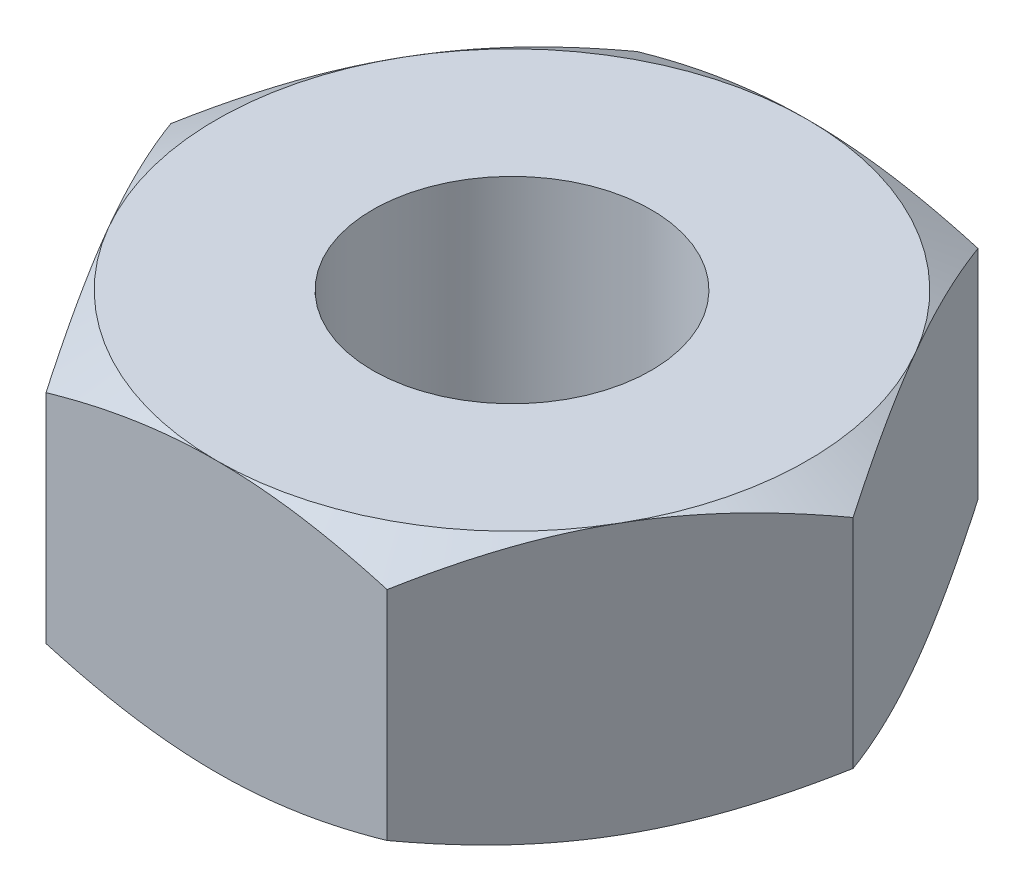
ISO-10303-21;
HEADER;
FILE_DESCRIPTION(('STEP AP214'),'2;1');
FILE_NAME('part.step','',(''),(''),'','','');
FILE_SCHEMA(('AUTOMOTIVE_DESIGN { 1 0 10303 214 1 1 1 1 }'));
ENDSEC;
DATA;
#1=APPLICATION_CONTEXT('core data for automotive mechanical design processes');
#2=APPLICATION_PROTOCOL_DEFINITION('international standard','automotive_design',2000,#1);
#3=PRODUCT_CONTEXT('',#1,'mechanical');
#4=PRODUCT('Part','Part','',(#3));
#5=PRODUCT_RELATED_PRODUCT_CATEGORY('part','',(#4));
#6=PRODUCT_DEFINITION_FORMATION('','',#4);
#7=PRODUCT_DEFINITION_CONTEXT('part definition',#1,'design');
#8=PRODUCT_DEFINITION('design','',#6,#7);
#9=PRODUCT_DEFINITION_SHAPE('','',#8);
#10=(LENGTH_UNIT() NAMED_UNIT(*) SI_UNIT(.MILLI.,.METRE.));
#11=(NAMED_UNIT(*) PLANE_ANGLE_UNIT() SI_UNIT($,.RADIAN.));
#12=(NAMED_UNIT(*) SI_UNIT($,.STERADIAN.) SOLID_ANGLE_UNIT());
#13=UNCERTAINTY_MEASURE_WITH_UNIT(LENGTH_MEASURE(1.E-05),#10,'distance_accuracy_value','');
#14=(GEOMETRIC_REPRESENTATION_CONTEXT(3) GLOBAL_UNCERTAINTY_ASSIGNED_CONTEXT((#13)) GLOBAL_UNIT_ASSIGNED_CONTEXT((#10,
#11,#12)) REPRESENTATION_CONTEXT('',''));
#15=CARTESIAN_POINT('',(0.,0.,0.));
#16=DIRECTION('',(0.,0.,1.));
#17=DIRECTION('',(1.,0.,0.));
#18=AXIS2_PLACEMENT_3D('',#15,#16,#17);
#19=CARTESIAN_POINT('',(0.,0.,0.));
#20=DIRECTION('',(0.,1.,0.));
#21=DIRECTION('',(0.,0.,1.));
#22=AXIS2_PLACEMENT_3D('',#19,#20,#21);
#23=PLANE('',#22);
#24=CARTESIAN_POINT('',(0.,0.,0.));
#25=DIRECTION('',(0.,1.,0.));
#26=DIRECTION('',(0.,0.,1.));
#27=AXIS2_PLACEMENT_3D('',#24,#25,#26);
#28=CIRCLE('',#27,1.65);
#29=CARTESIAN_POINT('',(0.,0.,1.65));
#30=VERTEX_POINT('',#29);
#31=EDGE_CURVE('E151',#30,#30,#28,.T.);
#32=ORIENTED_EDGE('',*,*,#31,.T.);
#33=EDGE_LOOP('',(#32));
#34=FACE_BOUND('',#33,.T.);
#35=CARTESIAN_POINT('',(0.,0.,0.));
#36=DIRECTION('',(0.,1.,0.));
#37=DIRECTION('',(0.,0.,1.));
#38=AXIS2_PLACEMENT_3D('',#35,#36,#37);
#39=CIRCLE('',#38,3.5);
#40=CARTESIAN_POINT('',(3.03108891324554,0.,1.75));
#41=VERTEX_POINT('',#40);
#42=CARTESIAN_POINT('',(0.,0.,3.5));
#43=VERTEX_POINT('',#42);
#44=EDGE_CURVE('E280',#41,#43,#39,.F.);
#45=ORIENTED_EDGE('',*,*,#44,.T.);
#46=CARTESIAN_POINT('',(-3.03108891324554,0.,1.75));
#47=VERTEX_POINT('',#46);
#48=EDGE_CURVE('E279',#43,#47,#39,.F.);
#49=ORIENTED_EDGE('',*,*,#48,.T.);
#50=CARTESIAN_POINT('',(-3.03108891324554,0.,-1.75));
#51=VERTEX_POINT('',#50);
#52=EDGE_CURVE('E156',#47,#51,#39,.F.);
#53=ORIENTED_EDGE('',*,*,#52,.T.);
#54=CARTESIAN_POINT('',(0.,0.,-3.5));
#55=VERTEX_POINT('',#54);
#56=EDGE_CURVE('E130',#51,#55,#39,.F.);
#57=ORIENTED_EDGE('',*,*,#56,.T.);
#58=CARTESIAN_POINT('',(0.,0.,0.));
#59=DIRECTION('',(0.,-1.,0.));
#60=DIRECTION('',(0.,0.,-1.));
#61=AXIS2_PLACEMENT_3D('',#58,#59,#60);
#62=CIRCLE('',#61,3.5);
#63=CARTESIAN_POINT('',(3.03108891324554,0.,-1.75));
#64=VERTEX_POINT('',#63);
#65=EDGE_CURVE('E142',#55,#64,#62,.T.);
#66=ORIENTED_EDGE('',*,*,#65,.T.);
#67=EDGE_CURVE('E157',#64,#41,#39,.F.);
#68=ORIENTED_EDGE('',*,*,#67,.T.);
#69=EDGE_LOOP('',(#45,#49,#53,#57,#66,#68));
#70=FACE_BOUND('',#69,.T.);
#71=ADVANCED_FACE('F35',(#34,#70),#23,.F.);
#72=CARTESIAN_POINT('',(0.,1.22816164847295,0.));
#73=DIRECTION('',(0.,1.,0.));
#74=DIRECTION('',(0.,0.,1.));
#75=AXIS2_PLACEMENT_3D('',#72,#73,#74);
#76=CONICAL_SURFACE('',#75,5.62723837506273,1.0471975511966);
#77=ORIENTED_EDGE('',*,*,#44,.F.);
#78=CARTESIAN_POINT('',(2.02061047210985,0.312674060693367,3.5002));
#79=CARTESIAN_POINT('',(2.10941108799267,0.261385788989981,3.34639282154755));
#80=CARTESIAN_POINT('',(2.19897822522909,0.214740953816195,3.19125798916558));
#81=CARTESIAN_POINT('',(2.37966345361545,0.133321875533347,2.87830199342322));
#82=CARTESIAN_POINT('',(2.47078475532382,0.0985764355845599,2.72047526921251));
#83=CARTESIAN_POINT('',(2.65189807961073,0.0444900271828351,2.40677778961987));
#84=CARTESIAN_POINT('',(2.74186223545399,0.0247890862603809,2.25095530083931));
#85=CARTESIAN_POINT('',(2.92221386641055,0.00127013273725374,1.93857711279463));
#86=CARTESIAN_POINT('',(3.01260068598001,-0.00256735545443569,1.78202254896577));
#87=CARTESIAN_POINT('',(3.1814939814933,0.00541530187697676,1.48949078007901));
#88=CARTESIAN_POINT('',(3.26002573814993,0.0152754340696065,1.3534697875421));
#89=CARTESIAN_POINT('',(3.41657761679353,0.0465264668994025,1.08231397971101));
#90=CARTESIAN_POINT('',(3.49459719728457,0.0679280432857964,0.947180102315318));
#91=CARTESIAN_POINT('',(3.65147186489429,0.121430407880574,0.675465207594816));
#92=CARTESIAN_POINT('',(3.73030709667644,0.153757994445084,0.538918580721664));
#93=CARTESIAN_POINT('',(3.88680174018324,0.227128933807991,0.267861907055498));
#94=CARTESIAN_POINT('',(3.96446315689009,0.268155046569863,0.133348387531462));
#95=CARTESIAN_POINT('',(4.04156735438122,0.312674060693366,-0.000200000000001687));
#96=B_SPLINE_CURVE_WITH_KNOTS('',3,(#78,#79,#80,#81,#82,#83,#84,#85,#86,#87,#88,#89,#90,#91,#92,
#93,#94,#95),.UNSPECIFIED.,.F.,.F.,(4,2,2,2,2,2,2,2,4),(0.,0.554793832886253,1.11092123814983,
1.65328467083218,2.19498204478403,2.6666513085086,3.13875761298267,3.6213361260051,
4.10296698719187),.UNSPECIFIED.);
#97=CARTESIAN_POINT('',(2.02072594216369,0.312607391169639,3.5));
#98=VERTEX_POINT('',#97);
#99=EDGE_CURVE('E257',#98,#41,#96,.T.);
#100=ORIENTED_EDGE('',*,*,#99,.F.);
#101=CARTESIAN_POINT('',(-5.48729658965249,1.73695170335139,3.5));
#102=CARTESIAN_POINT('',(-5.33392430085366,1.66231559563495,3.5));
#103=CARTESIAN_POINT('',(-5.18020625802091,1.58837813234244,3.5));
#104=CARTESIAN_POINT('',(-4.8718950259587,1.44229225276296,3.5));
#105=CARTESIAN_POINT('',(-4.71730170861734,1.37014410714904,3.5));
#106=CARTESIAN_POINT('',(-4.40628784057483,1.22767822236962,3.5));
#107=CARTESIAN_POINT('',(-4.2498619576129,1.1573720847729,3.5));
#108=CARTESIAN_POINT('',(-3.93578669068732,1.01955855889005,3.5));
#109=CARTESIAN_POINT('',(-3.77813736321806,0.95205104227559,3.5));
#110=CARTESIAN_POINT('',(-3.45604443012576,0.818363440114217,3.5));
#111=CARTESIAN_POINT('',(-3.29155045193887,0.752304069788896,3.5));
#112=CARTESIAN_POINT('',(-2.9606600103715,0.625042672367849,3.5));
#113=CARTESIAN_POINT('',(-2.79426333905985,0.563841182071312,3.5));
#114=CARTESIAN_POINT('',(-2.45959558218632,0.447858870727703,3.5));
#115=CARTESIAN_POINT('',(-2.29132887268079,0.393065546521848,3.5));
#116=CARTESIAN_POINT('',(-1.9523821328414,0.291618520399898,3.5));
#117=CARTESIAN_POINT('',(-1.78170286179995,0.244962316590665,3.5));
#118=CARTESIAN_POINT('',(-1.43879819380852,0.162241996204664,3.5));
#119=CARTESIAN_POINT('',(-1.26658750180278,0.126118027114173,3.5));
#120=CARTESIAN_POINT('',(-0.919963256985166,0.066459068032102,3.5));
#121=CARTESIAN_POINT('',(-0.745549931210552,0.0429227912273358,3.5));
#122=CARTESIAN_POINT('',(-0.397693551886164,0.0106222413759194,3.5));
#123=CARTESIAN_POINT('',(-0.224269014445122,0.00166348770931015,3.5));
#124=CARTESIAN_POINT('',(0.122721845126118,-0.00123825745789188,3.5));
#125=CARTESIAN_POINT('',(0.296288168586616,0.00481889358314598,3.5));
#126=CARTESIAN_POINT('',(0.589219840270773,0.0272790813565937,3.5));
#127=CARTESIAN_POINT('',(0.708890812816835,0.0399416067329044,3.5));
#128=CARTESIAN_POINT('',(0.947390012911368,0.0716482125475473,3.5));
#129=CARTESIAN_POINT('',(1.06621813033613,0.0906931117473435,3.5));
#130=CARTESIAN_POINT('',(1.42126185221794,0.156403924689997,3.5));
#131=CARTESIAN_POINT('',(1.65591172022923,0.211635054533135,3.5));
#132=CARTESIAN_POINT('',(2.00685115721309,0.307829880729818,3.5));
#133=CARTESIAN_POINT('',(2.12494860403868,0.342577526452013,3.5));
#134=CARTESIAN_POINT('',(2.35999739802804,0.415787969126921,3.5));
#135=CARTESIAN_POINT('',(2.47694873728945,0.454250791675727,3.5));
#136=CARTESIAN_POINT('',(2.70974025440677,0.534265603347491,3.5));
#137=CARTESIAN_POINT('',(2.82558075890641,0.575816650830188,3.5));
#138=CARTESIAN_POINT('',(3.05629500358883,0.661508548117771,3.5));
#139=CARTESIAN_POINT('',(3.17116875766164,0.705649360640692,3.5));
#140=CARTESIAN_POINT('',(3.45170401361437,0.816500991608655,3.5));
#141=CARTESIAN_POINT('',(3.61689200749512,0.884408240360573,3.5));
#142=CARTESIAN_POINT('',(3.94577423358815,1.02375948993126,3.5));
#143=CARTESIAN_POINT('',(4.10946835423335,1.09520375238619,3.5));
#144=CARTESIAN_POINT('',(4.43565302963581,1.24088567278799,3.5));
#145=CARTESIAN_POINT('',(4.59814328209744,1.31512400566201,3.5));
#146=CARTESIAN_POINT('',(4.92209647238783,1.46581286528313,3.5));
#147=CARTESIAN_POINT('',(5.08355938499594,1.5422634460861,3.5));
#148=CARTESIAN_POINT('',(5.56706919332015,1.77444708427745,3.5));
#149=CARTESIAN_POINT('',(5.88784135389833,1.9328325286253,3.5));
#150=CARTESIAN_POINT('',(6.52696341521593,2.25427109829531,3.5));
#151=CARTESIAN_POINT('',(6.84531365901071,2.41732354636336,3.5));
#152=CARTESIAN_POINT('',(7.45183610633812,2.73195047030358,3.5));
#153=CARTESIAN_POINT('',(7.74015473681264,2.88324320032203,3.5));
#154=CARTESIAN_POINT('',(8.31572973213904,3.18786189634162,3.5));
#155=CARTESIAN_POINT('',(8.60298605139876,3.34118794834278,3.5));
#156=CARTESIAN_POINT('',(9.17587286213092,3.64894851445291,3.5));
#157=CARTESIAN_POINT('',(9.46150565350082,3.80337875289216,3.5));
#158=CARTESIAN_POINT('',(10.0320972225393,4.1134378140451,3.5));
#159=CARTESIAN_POINT('',(10.3170560410401,4.26906656158344,3.5));
#160=CARTESIAN_POINT('',(10.6017698545389,4.42513898683299,3.5));
#161=B_SPLINE_CURVE_WITH_KNOTS('',3,(#101,#102,#103,#104,#105,#106,#107,#108,#109,#110,#111,
#112,#113,#114,#115,#116,#117,#118,#119,#120,#121,#122,#123,#124,#125,#126,#127,#128,#129,#130,
#131,#132,#133,#134,#135,#136,#137,#138,#139,#140,#141,#142,#143,#144,#145,#146,#147,#148,#149,
#150,#151,#152,#153,#154,#155,#156,#157,#158,#159,#160),.UNSPECIFIED.,.F.,.F.,(4,2,2,2,2,2,2,2,
2,2,2,2,2,2,2,2,2,2,2,2,2,2,2,2,2,2,2,2,2,4),(0.,0.511711420750815,1.02349978253115,
1.53797569600388,2.05242799248159,2.58415713333799,3.11594494908066,3.64667722816307,
4.17724603598176,4.70473818226392,5.23217639382616,5.75251851191488,6.27286556947941,
6.63370867372313,6.99459808637886,7.7167519313293,8.08602879423068,8.45530820148453,
8.8244754689275,9.19363742318364,9.72938462744612,10.2651715208096,10.8010886785131,
11.3370189423283,12.4101829682849,13.4831920433729,14.4599893268876,15.4368280569714,
16.4109466040954,17.3850045403099),.UNSPECIFIED.);
#162=EDGE_CURVE('E251',#43,#98,#161,.T.);
#163=ORIENTED_EDGE('',*,*,#162,.F.);
#164=EDGE_LOOP('',(#77,#100,#163));
#165=FACE_BOUND('',#164,.T.);
#166=ADVANCED_FACE('F283',(#165),#76,.T.);
#167=ORIENTED_EDGE('',*,*,#67,.F.);
#168=CARTESIAN_POINT('',(4.04156735438122,0.312674060693367,0.000199999999998603));
#169=CARTESIAN_POINT('',(3.9527667384984,0.26138578898998,-0.153607178452451));
#170=CARTESIAN_POINT('',(3.86319960126198,0.214740953816194,-0.308742010834425));
#171=CARTESIAN_POINT('',(3.68251437287562,0.133321875533347,-0.621698006576782));
#172=CARTESIAN_POINT('',(3.59139307116725,0.0985764355845596,-0.779524730787496));
#173=CARTESIAN_POINT('',(3.41027974688034,0.044490027182835,-1.09322221038013));
#174=CARTESIAN_POINT('',(3.32031559103708,0.024789086260381,-1.24904469916069));
#175=CARTESIAN_POINT('',(3.13996396008052,0.00127013273725415,-1.56142288720537));
#176=CARTESIAN_POINT('',(3.04957714051106,-0.00256735545443513,-1.71797745103423));
#177=CARTESIAN_POINT('',(2.88068384499777,0.00541530187697698,-2.01050921992099));
#178=CARTESIAN_POINT('',(2.80215208834114,0.0152754340696062,-2.14653021245791));
#179=CARTESIAN_POINT('',(2.64560020969753,0.0465264668994023,-2.41768602028899));
#180=CARTESIAN_POINT('',(2.5675806292065,0.0679280432857968,-2.55281989768468));
#181=CARTESIAN_POINT('',(2.41070596159678,0.121430407880575,-2.82453479240518));
#182=CARTESIAN_POINT('',(2.33187072981463,0.153757994445084,-2.96108141927834));
#183=CARTESIAN_POINT('',(2.17537608630783,0.227128933807991,-3.2321380929445));
#184=CARTESIAN_POINT('',(2.09771466960098,0.268155046569863,-3.36665161246854));
#185=CARTESIAN_POINT('',(2.02061047210985,0.312674060693367,-3.5002));
#186=B_SPLINE_CURVE_WITH_KNOTS('',3,(#168,#169,#170,#171,#172,#173,#174,#175,#176,#177,#178,
#179,#180,#181,#182,#183,#184,#185),.UNSPECIFIED.,.F.,.F.,(4,2,2,2,2,2,2,2,4),(0.,
0.554793832886253,1.11092123814983,1.65328467083218,2.19498204478403,2.6666513085086,
3.13875761298267,3.62133612600509,4.10296698719187),.UNSPECIFIED.);
#187=CARTESIAN_POINT('',(4.04145188432738,0.312607391169639,0.));
#188=VERTEX_POINT('',#187);
#189=EDGE_CURVE('E163',#188,#64,#186,.T.);
#190=ORIENTED_EDGE('',*,*,#189,.F.);
#191=EDGE_CURVE('E258',#41,#188,#96,.T.);
#192=ORIENTED_EDGE('',*,*,#191,.F.);
#193=EDGE_LOOP('',(#167,#190,#192));
#194=FACE_BOUND('',#193,.T.);
#195=ADVANCED_FACE('F351',(#194),#76,.T.);
#196=ORIENTED_EDGE('',*,*,#65,.F.);
#197=CARTESIAN_POINT('',(-5.48729658965249,1.73695170335139,-3.5));
#198=CARTESIAN_POINT('',(-5.33392430085366,1.66231559563495,-3.5));
#199=CARTESIAN_POINT('',(-5.18020625802091,1.58837813234244,-3.5));
#200=CARTESIAN_POINT('',(-4.8718950259587,1.44229225276296,-3.5));
#201=CARTESIAN_POINT('',(-4.71730170861734,1.37014410714904,-3.5));
#202=CARTESIAN_POINT('',(-4.40628784057483,1.22767822236962,-3.5));
#203=CARTESIAN_POINT('',(-4.2498619576129,1.1573720847729,-3.5));
#204=CARTESIAN_POINT('',(-3.93578669068732,1.01955855889005,-3.5));
#205=CARTESIAN_POINT('',(-3.77813736321806,0.95205104227559,-3.5));
#206=CARTESIAN_POINT('',(-3.45604443012576,0.818363440114217,-3.5));
#207=CARTESIAN_POINT('',(-3.29155045193887,0.752304069788895,-3.5));
#208=CARTESIAN_POINT('',(-2.9606600103715,0.625042672367849,-3.5));
#209=CARTESIAN_POINT('',(-2.79426333905984,0.563841182071312,-3.5));
#210=CARTESIAN_POINT('',(-2.45959558218632,0.447858870727703,-3.5));
#211=CARTESIAN_POINT('',(-2.29132887268079,0.393065546521848,-3.5));
#212=CARTESIAN_POINT('',(-1.9523821328414,0.291618520399898,-3.5));
#213=CARTESIAN_POINT('',(-1.78170286179995,0.244962316590665,-3.5));
#214=CARTESIAN_POINT('',(-1.43879819380852,0.162241996204664,-3.5));
#215=CARTESIAN_POINT('',(-1.26658750180278,0.126118027114173,-3.5));
#216=CARTESIAN_POINT('',(-0.919963256985164,0.0664590680321019,-3.5));
#217=CARTESIAN_POINT('',(-0.745549931210551,0.0429227912273355,-3.5));
#218=CARTESIAN_POINT('',(-0.397693551886163,0.0106222413759191,-3.5));
#219=CARTESIAN_POINT('',(-0.224269014445121,0.0016634877093101,-3.5));
#220=CARTESIAN_POINT('',(0.122721845126119,-0.00123825745789195,-3.5));
#221=CARTESIAN_POINT('',(0.296288168586616,0.00481889358314567,-3.5));
#222=CARTESIAN_POINT('',(0.589219840270773,0.0272790813565934,-3.5));
#223=CARTESIAN_POINT('',(0.708890812816835,0.0399416067329043,-3.5));
#224=CARTESIAN_POINT('',(0.947390012911369,0.0716482125475472,-3.5));
#225=CARTESIAN_POINT('',(1.06621813033613,0.0906931117473435,-3.5));
#226=CARTESIAN_POINT('',(1.42126185221794,0.156403924689997,-3.5));
#227=CARTESIAN_POINT('',(1.65591172022924,0.211635054533134,-3.5));
#228=CARTESIAN_POINT('',(2.00685115721308,0.307829880729818,-3.5));
#229=CARTESIAN_POINT('',(2.12494860403868,0.342577526452013,-3.5));
#230=CARTESIAN_POINT('',(2.35999739802803,0.415787969126921,-3.5));
#231=CARTESIAN_POINT('',(2.47694873728944,0.454250791675726,-3.5));
#232=CARTESIAN_POINT('',(2.70974025440677,0.53426560334749,-3.5));
#233=CARTESIAN_POINT('',(2.82558075890641,0.575816650830187,-3.5));
#234=CARTESIAN_POINT('',(3.05629500358883,0.661508548117771,-3.5));
#235=CARTESIAN_POINT('',(3.17116875766164,0.705649360640692,-3.5));
#236=CARTESIAN_POINT('',(3.45170401361437,0.816500991608655,-3.5));
#237=CARTESIAN_POINT('',(3.61689200749512,0.884408240360573,-3.5));
#238=CARTESIAN_POINT('',(3.94577423358815,1.02375948993126,-3.5));
#239=CARTESIAN_POINT('',(4.10946835423336,1.09520375238619,-3.5));
#240=CARTESIAN_POINT('',(4.43565302963582,1.24088567278799,-3.5));
#241=CARTESIAN_POINT('',(4.59814328209744,1.31512400566201,-3.5));
#242=CARTESIAN_POINT('',(4.92209647238783,1.46581286528313,-3.5));
#243=CARTESIAN_POINT('',(5.08355938499594,1.5422634460861,-3.5));
#244=CARTESIAN_POINT('',(5.56706919332015,1.77444708427745,-3.5));
#245=CARTESIAN_POINT('',(5.88784135389833,1.9328325286253,-3.5));
#246=CARTESIAN_POINT('',(6.52696341521594,2.25427109829531,-3.5));
#247=CARTESIAN_POINT('',(6.84531365901072,2.41732354636336,-3.5));
#248=CARTESIAN_POINT('',(7.45183610633813,2.73195047030358,-3.5));
#249=CARTESIAN_POINT('',(7.74015473681265,2.88324320032203,-3.5));
#250=CARTESIAN_POINT('',(8.31572973213905,3.18786189634162,-3.5));
#251=CARTESIAN_POINT('',(8.60298605139876,3.34118794834278,-3.5));
#252=CARTESIAN_POINT('',(9.17587286213093,3.64894851445291,-3.5));
#253=CARTESIAN_POINT('',(9.46150565350082,3.80337875289217,-3.5));
#254=CARTESIAN_POINT('',(10.0320972225393,4.1134378140451,-3.5));
#255=CARTESIAN_POINT('',(10.3170560410401,4.26906656158344,-3.5));
#256=CARTESIAN_POINT('',(10.6017698545389,4.42513898683299,-3.5));
#257=B_SPLINE_CURVE_WITH_KNOTS('',3,(#197,#198,#199,#200,#201,#202,#203,#204,#205,#206,#207,
#208,#209,#210,#211,#212,#213,#214,#215,#216,#217,#218,#219,#220,#221,#222,#223,#224,#225,#226,
#227,#228,#229,#230,#231,#232,#233,#234,#235,#236,#237,#238,#239,#240,#241,#242,#243,#244,#245,
#246,#247,#248,#249,#250,#251,#252,#253,#254,#255,#256),.UNSPECIFIED.,.F.,.F.,(4,2,2,2,2,2,2,2,
2,2,2,2,2,2,2,2,2,2,2,2,2,2,2,2,2,2,2,2,2,4),(0.,0.511711420750815,1.02349978253115,
1.53797569600388,2.05242799248159,2.58415713333799,3.11594494908066,3.64667722816307,
4.17724603598176,4.70473818226392,5.23217639382616,5.75251851191488,6.27286556947941,
6.63370867372313,6.99459808637886,7.7167519313293,8.08602879423068,8.45530820148452,
8.8244754689275,9.19363742318364,9.72938462744612,10.2651715208096,10.8010886785131,
11.3370189423283,12.4101829682849,13.4831920433729,14.4599893268876,15.4368280569714,
16.4109466040954,17.3850045403099),.UNSPECIFIED.);
#258=CARTESIAN_POINT('',(2.02072594216369,0.312607391169639,-3.5));
#259=VERTEX_POINT('',#258);
#260=EDGE_CURVE('E138',#259,#55,#257,.F.);
#261=ORIENTED_EDGE('',*,*,#260,.F.);
#262=EDGE_CURVE('E145',#64,#259,#186,.T.);
#263=ORIENTED_EDGE('',*,*,#262,.F.);
#264=EDGE_LOOP('',(#196,#261,#263));
#265=FACE_BOUND('',#264,.T.);
#266=ADVANCED_FACE('F143',(#265),#76,.T.);
#267=ORIENTED_EDGE('',*,*,#56,.F.);
#268=CARTESIAN_POINT('',(-2.02061047210985,0.312674060693367,-3.5002));
#269=CARTESIAN_POINT('',(-2.10941108799267,0.26138578898998,-3.34639282154755));
#270=CARTESIAN_POINT('',(-2.19897822522909,0.214740953816194,-3.19125798916558));
#271=CARTESIAN_POINT('',(-2.37966345361545,0.133321875533347,-2.87830199342322));
#272=CARTESIAN_POINT('',(-2.47078475532382,0.0985764355845598,-2.72047526921251));
#273=CARTESIAN_POINT('',(-2.65189807961073,0.044490027182835,-2.40677778961987));
#274=CARTESIAN_POINT('',(-2.74186223545399,0.0247890862603809,-2.25095530083931));
#275=CARTESIAN_POINT('',(-2.92221386641055,0.00127013273725396,-1.93857711279463));
#276=CARTESIAN_POINT('',(-3.01260068598001,-0.00256735545443538,-1.78202254896577));
#277=CARTESIAN_POINT('',(-3.1814939814933,0.00541530187697697,-1.48949078007901));
#278=CARTESIAN_POINT('',(-3.26002573814993,0.0152754340696065,-1.3534697875421));
#279=CARTESIAN_POINT('',(-3.41657761679354,0.0465264668994025,-1.08231397971101));
#280=CARTESIAN_POINT('',(-3.49459719728457,0.0679280432857965,-0.947180102315318));
#281=CARTESIAN_POINT('',(-3.65147186489429,0.121430407880575,-0.675465207594817));
#282=CARTESIAN_POINT('',(-3.73030709667644,0.153757994445084,-0.538918580721665));
#283=CARTESIAN_POINT('',(-3.88680174018324,0.227128933807991,-0.267861907055498));
#284=CARTESIAN_POINT('',(-3.96446315689009,0.268155046569863,-0.133348387531463));
#285=CARTESIAN_POINT('',(-4.04156735438122,0.312674060693367,0.000200000000001254));
#286=B_SPLINE_CURVE_WITH_KNOTS('',3,(#268,#269,#270,#271,#272,#273,#274,#275,#276,#277,#278,
#279,#280,#281,#282,#283,#284,#285),.UNSPECIFIED.,.F.,.F.,(4,2,2,2,2,2,2,2,4),(0.,
0.554793832886253,1.11092123814983,1.65328467083218,2.19498204478403,2.6666513085086,
3.13875761298267,3.6213361260051,4.10296698719187),.UNSPECIFIED.);
#287=CARTESIAN_POINT('',(-2.02072594216369,0.312607391169639,-3.5));
#288=VERTEX_POINT('',#287);
#289=EDGE_CURVE('E133',#288,#51,#286,.T.);
#290=ORIENTED_EDGE('',*,*,#289,.F.);
#291=EDGE_CURVE('E126',#55,#288,#257,.F.);
#292=ORIENTED_EDGE('',*,*,#291,.F.);
#293=EDGE_LOOP('',(#267,#290,#292));
#294=FACE_BOUND('',#293,.T.);
#295=ADVANCED_FACE('F128',(#294),#76,.T.);
#296=CARTESIAN_POINT('',(-4.04145188432738,0.312607391169639,0.));
#297=VERTEX_POINT('',#296);
#298=EDGE_CURVE('E171',#51,#297,#286,.T.);
#299=ORIENTED_EDGE('',*,*,#298,.F.);
#300=ORIENTED_EDGE('',*,*,#52,.F.);
#301=CARTESIAN_POINT('',(-4.04156735438122,0.312674060693367,-0.000199999999999168));
#302=CARTESIAN_POINT('',(-3.9527667384984,0.26138578898998,0.15360717845245));
#303=CARTESIAN_POINT('',(-3.86319960126198,0.214740953816194,0.308742010834424));
#304=CARTESIAN_POINT('',(-3.68251437287562,0.133321875533347,0.621698006576782));
#305=CARTESIAN_POINT('',(-3.59139307116725,0.0985764355845599,0.779524730787496));
#306=CARTESIAN_POINT('',(-3.41027974688034,0.0444900271828353,1.09322221038013));
#307=CARTESIAN_POINT('',(-3.32031559103708,0.024789086260381,1.24904469916069));
#308=CARTESIAN_POINT('',(-3.13996396008052,0.001270132737254,1.56142288720537));
#309=CARTESIAN_POINT('',(-3.04957714051106,-0.00256735545443526,1.71797745103423));
#310=CARTESIAN_POINT('',(-2.88068384499777,0.00541530187697712,2.01050921992099));
#311=CARTESIAN_POINT('',(-2.80215208834114,0.0152754340696066,2.14653021245791));
#312=CARTESIAN_POINT('',(-2.64560020969753,0.0465264668994026,2.41768602028899));
#313=CARTESIAN_POINT('',(-2.5675806292065,0.0679280432857967,2.55281989768468));
#314=CARTESIAN_POINT('',(-2.41070596159678,0.121430407880575,2.82453479240518));
#315=CARTESIAN_POINT('',(-2.33187072981463,0.153757994445085,2.96108141927834));
#316=CARTESIAN_POINT('',(-2.17537608630783,0.227128933807991,3.2321380929445));
#317=CARTESIAN_POINT('',(-2.09771466960098,0.268155046569863,3.36665161246854));
#318=CARTESIAN_POINT('',(-2.02061047210985,0.312674060693367,3.5002));
#319=B_SPLINE_CURVE_WITH_KNOTS('',3,(#301,#302,#303,#304,#305,#306,#307,#308,#309,#310,#311,
#312,#313,#314,#315,#316,#317,#318),.UNSPECIFIED.,.F.,.F.,(4,2,2,2,2,2,2,2,4),(0.,
0.554793832886253,1.11092123814983,1.65328467083218,2.19498204478403,2.6666513085086,
3.13875761298267,3.62133612600509,4.10296698719187),.UNSPECIFIED.);
#320=EDGE_CURVE('E267',#297,#47,#319,.T.);
#321=ORIENTED_EDGE('',*,*,#320,.F.);
#322=EDGE_LOOP('',(#299,#300,#321));
#323=FACE_BOUND('',#322,.T.);
#324=ADVANCED_FACE('F181',(#323),#76,.T.);
#325=ORIENTED_EDGE('',*,*,#48,.F.);
#326=CARTESIAN_POINT('',(-2.02072594216393,0.312607391169482,3.5));
#327=VERTEX_POINT('',#326);
#328=EDGE_CURVE('E256',#327,#43,#161,.T.);
#329=ORIENTED_EDGE('',*,*,#328,.F.);
#330=EDGE_CURVE('E262',#47,#327,#319,.T.);
#331=ORIENTED_EDGE('',*,*,#330,.F.);
#332=EDGE_LOOP('',(#325,#329,#331));
#333=FACE_BOUND('',#332,.T.);
#334=ADVANCED_FACE('F278',(#333),#76,.T.);
#335=CARTESIAN_POINT('',(-4.04145188432738,3.2,0.));
#336=DIRECTION('',(0.866025403784439,0.,-0.5));
#337=DIRECTION('',(-0.5,0.,-0.866025403784439));
#338=AXIS2_PLACEMENT_3D('',#335,#336,#337);
#339=PLANE('',#338);
#340=DIRECTION('',(0.,-1.,0.));
#341=VECTOR('',#340,1.);
#342=CARTESIAN_POINT('',(-2.02072594216369,3.2,3.5));
#343=LINE('',#342,#341);
#344=CARTESIAN_POINT('',(-2.02072594216369,2.88739260883036,3.5));
#345=VERTEX_POINT('',#344);
#346=EDGE_CURVE('E276',#345,#327,#343,.T.);
#347=ORIENTED_EDGE('',*,*,#346,.F.);
#348=CARTESIAN_POINT('',(-2.02061047210985,2.88732593930663,3.5002));
#349=CARTESIAN_POINT('',(-2.10941108799267,2.93861421101002,3.34639282154755));
#350=CARTESIAN_POINT('',(-2.19897822522909,2.98525904618381,3.19125798916558));
#351=CARTESIAN_POINT('',(-2.37966345361545,3.06667812446665,2.87830199342322));
#352=CARTESIAN_POINT('',(-2.47078475532382,3.10142356441544,2.72047526921251));
#353=CARTESIAN_POINT('',(-2.65189807961073,3.15550997281716,2.40677778961987));
#354=CARTESIAN_POINT('',(-2.74186223545399,3.17521091373962,2.25095530083931));
#355=CARTESIAN_POINT('',(-2.92221386641055,3.19872986726275,1.93857711279463));
#356=CARTESIAN_POINT('',(-3.01260068598001,3.20256735545444,1.78202254896577));
#357=CARTESIAN_POINT('',(-3.1814939814933,3.19458469812302,1.48949078007901));
#358=CARTESIAN_POINT('',(-3.26002573814993,3.18472456593039,1.3534697875421));
#359=CARTESIAN_POINT('',(-3.41657761679354,3.1534735331006,1.08231397971101));
#360=CARTESIAN_POINT('',(-3.49459719728457,3.1320719567142,0.947180102315319));
#361=CARTESIAN_POINT('',(-3.65147186489429,3.07856959211943,0.675465207594818));
#362=CARTESIAN_POINT('',(-3.73030709667644,3.04624200555492,0.538918580721666));
#363=CARTESIAN_POINT('',(-3.88680174018324,2.97287106619201,0.267861907055499));
#364=CARTESIAN_POINT('',(-3.96446315689009,2.93184495343014,0.133348387531464));
#365=CARTESIAN_POINT('',(-4.04156735438122,2.88732593930663,-0.000199999999999404));
#366=B_SPLINE_CURVE_WITH_KNOTS('',3,(#348,#349,#350,#351,#352,#353,#354,#355,#356,#357,#358,
#359,#360,#361,#362,#363,#364,#365),.UNSPECIFIED.,.F.,.F.,(4,2,2,2,2,2,2,2,4),(0.,
0.554793832886252,1.11092123814983,1.65328467083218,2.19498204478403,2.6666513085086,
3.13875761298267,3.62133612600509,4.10296698719187),.UNSPECIFIED.);
#367=CARTESIAN_POINT('',(-3.03108891324554,3.2,1.75));
#368=VERTEX_POINT('',#367);
#369=EDGE_CURVE('E308',#345,#368,#366,.T.);
#370=ORIENTED_EDGE('',*,*,#369,.T.);
#371=CARTESIAN_POINT('',(-4.04145188432738,2.88739260883036,0.));
#372=VERTEX_POINT('',#371);
#373=EDGE_CURVE('E52',#368,#372,#366,.T.);
#374=ORIENTED_EDGE('',*,*,#373,.T.);
#375=DIRECTION('',(0.,-1.,0.));
#376=VECTOR('',#375,1.);
#377=CARTESIAN_POINT('',(-4.04145188432738,3.2,0.));
#378=LINE('',#377,#376);
#379=EDGE_CURVE('E294',#372,#297,#378,.T.);
#380=ORIENTED_EDGE('',*,*,#379,.T.);
#381=ORIENTED_EDGE('',*,*,#320,.T.);
#382=ORIENTED_EDGE('',*,*,#330,.T.);
#383=EDGE_LOOP('',(#347,#370,#374,#380,#381,#382));
#384=FACE_BOUND('',#383,.T.);
#385=ADVANCED_FACE('F37',(#384),#339,.F.);
#386=CARTESIAN_POINT('',(-2.02072594216369,3.2,3.5));
#387=DIRECTION('',(0.,0.,-1.));
#388=DIRECTION('',(-1.,0.,0.));
#389=AXIS2_PLACEMENT_3D('',#386,#387,#388);
#390=PLANE('',#389);
#391=DIRECTION('',(0.,-1.,0.));
#392=VECTOR('',#391,1.);
#393=CARTESIAN_POINT('',(2.02072594216369,3.2,3.5));
#394=LINE('',#393,#392);
#395=CARTESIAN_POINT('',(2.02072594216369,2.88739260883036,3.5));
#396=VERTEX_POINT('',#395);
#397=EDGE_CURVE('E285',#396,#98,#394,.T.);
#398=ORIENTED_EDGE('',*,*,#397,.F.);
#399=CARTESIAN_POINT('',(-5.48871920013498,1.46235579638996,3.5));
#400=CARTESIAN_POINT('',(-5.33533449170444,1.53700355457172,3.5));
#401=CARTESIAN_POINT('',(-5.18160415040104,1.61095295835892,3.5));
#402=CARTESIAN_POINT('',(-4.87326863326341,1.75706348874366,3.5));
#403=CARTESIAN_POINT('',(-4.71866332948475,1.82922434504649,3.5));
#404=CARTESIAN_POINT('',(-4.40762647155666,1.97171637595969,3.5));
#405=CARTESIAN_POINT('',(-4.25118959156163,2.04203596420441,3.5));
#406=CARTESIAN_POINT('',(-3.93709273231279,2.17987768926528,3.5));
#407=CARTESIAN_POINT('',(-3.77943280949459,2.24739995425906,3.5));
#408=CARTESIAN_POINT('',(-3.45731352372226,2.38112142296945,3.5));
#409=CARTESIAN_POINT('',(-3.29280375281074,2.44719984699479,3.5));
#410=CARTESIAN_POINT('',(-2.96188207190944,2.57450128156007,3.5));
#411=CARTESIAN_POINT('',(-2.79546995410612,2.63572375572035,3.5));
#412=CARTESIAN_POINT('',(-2.46077121761443,2.75175044793477,3.5));
#413=CARTESIAN_POINT('',(-2.29248897050485,2.80656715279975,3.5));
#414=CARTESIAN_POINT('',(-1.95351096485544,2.9080635501634,3.5));
#415=CARTESIAN_POINT('',(-1.78281596520956,2.95474574227264,3.5));
#416=CARTESIAN_POINT('',(-1.4398800117356,3.03752014197563,3.5));
#417=CARTESIAN_POINT('',(-1.26765378047729,3.07367224056858,3.5));
#418=CARTESIAN_POINT('',(-0.920996837064684,3.13338903423954,3.5));
#419=CARTESIAN_POINT('',(-0.746566352509862,3.15695501819588,3.5));
#420=CARTESIAN_POINT('',(-0.398674896299862,3.18931387893303,3.5));
#421=CARTESIAN_POINT('',(-0.225232484108654,3.1983013597855,3.5));
#422=CARTESIAN_POINT('',(0.121796545657752,3.20125744522759,3.5));
#423=CARTESIAN_POINT('',(0.295383164558352,3.19522591021624,3.5));
#424=CARTESIAN_POINT('',(0.588308438038505,3.17280780937254,3.5));
#425=CARTESIAN_POINT('',(0.707952498949522,3.16016557355762,3.5));
#426=CARTESIAN_POINT('',(0.946398986443853,3.12850094673356,3.5));
#427=CARTESIAN_POINT('',(1.0652013032057,3.10947773830652,3.5));
#428=CARTESIAN_POINT('',(1.42016881206941,3.04383286463872,3.5));
#429=CARTESIAN_POINT('',(1.65476970590296,2.98864680934403,3.5));
#430=CARTESIAN_POINT('',(2.00563805940931,2.89251847167991,3.5));
#431=CARTESIAN_POINT('',(2.12371270004934,2.85779277535478,3.5));
#432=CARTESIAN_POINT('',(2.35871613930184,2.7846255847532,3.5));
#433=CARTESIAN_POINT('',(2.47564493000115,2.74618406483539,3.5));
#434=CARTESIAN_POINT('',(2.70839154707803,2.66621110964583,3.5));
#435=CARTESIAN_POINT('',(2.82420969929303,2.62468061399912,3.5));
#436=CARTESIAN_POINT('',(3.05487922933541,2.53902911955889,3.5));
#437=CARTESIAN_POINT('',(3.16973062114806,2.49490815831327,3.5));
#438=CARTESIAN_POINT('',(3.45054697568496,2.38397170517178,3.5));
#439=CARTESIAN_POINT('',(3.61603475868533,2.31595020919462,3.5));
#440=CARTESIAN_POINT('',(3.94551091910527,2.17635683352432,3.5));
#441=CARTESIAN_POINT('',(4.10949918384945,2.1047846895863,3.5));
#442=CARTESIAN_POINT('',(4.43626814532412,1.95883738509345,3.5));
#443=CARTESIAN_POINT('',(4.59904853700657,1.88446154349171,3.5));
#444=CARTESIAN_POINT('',(4.92357880379552,1.73349095823319,3.5));
#445=CARTESIAN_POINT('',(5.08532865350306,1.65689616014363,3.5));
#446=CARTESIAN_POINT('',(5.56969803111884,1.4242717296895,3.5));
#447=CARTESIAN_POINT('',(5.89103926131059,1.26558263570582,3.5));
#448=CARTESIAN_POINT('',(6.53129386650747,0.943527332178122,3.5));
#449=CARTESIAN_POINT('',(6.85020758729892,0.780161805170984,3.5));
#450=CARTESIAN_POINT('',(7.45774060476396,0.464964423383802,3.5));
#451=CARTESIAN_POINT('',(7.74650689413802,0.313415361652683,3.5));
#452=CARTESIAN_POINT('',(8.32297618577768,0.00828213736873168,3.5));
#453=CARTESIAN_POINT('',(8.61067914214576,-0.145302111748338,3.5));
#454=CARTESIAN_POINT('',(9.1844546625404,-0.45357793192125,3.5));
#455=CARTESIAN_POINT('',(9.47052953594813,-0.608265210201135,3.5));
#456=CARTESIAN_POINT('',(10.0420047917538,-0.918838873205213,3.5));
#457=CARTESIAN_POINT('',(10.327405215158,-1.07472518244189,3.5));
#458=CARTESIAN_POINT('',(10.6125605637479,-1.23105525166731,3.5));
#459=B_SPLINE_CURVE_WITH_KNOTS('',3,(#399,#400,#401,#402,#403,#404,#405,#406,#407,#408,#409,
#410,#411,#412,#413,#414,#415,#416,#417,#418,#419,#420,#421,#422,#423,#424,#425,#426,#427,#428,
#429,#430,#431,#432,#433,#434,#435,#436,#437,#438,#439,#440,#441,#442,#443,#444,#445,#446,#447,
#448,#449,#450,#451,#452,#453,#454,#455,#456,#457,#458),.UNSPECIFIED.,.F.,.F.,(4,2,2,2,2,2,2,2,
2,2,2,2,2,2,2,2,2,2,2,2,2,2,2,2,2,2,2,2,2,4),(0.,0.511760211336169,1.02359729673986,
1.53811986561927,2.05261883215215,2.58441329334089,3.11626641403855,3.6470648567819,
4.17769990459778,4.70525518436444,5.23275642958411,5.75315648069566,6.27356136891655,
6.63431785368968,6.99512056989469,7.71710026967122,8.08629287727152,8.45548803270014,
8.82457133961805,9.19364929812278,9.73035825244075,10.2671072095922,10.8039873995272,
11.3408807707344,12.4159786695926,13.4909204473813,14.4692642380462,15.4476497758087,
16.4233017178937,17.3988927304863),.UNSPECIFIED.);
#460=CARTESIAN_POINT('',(0.,3.2,3.5));
#461=VERTEX_POINT('',#460);
#462=EDGE_CURVE('E237',#396,#461,#459,.F.);
#463=ORIENTED_EDGE('',*,*,#462,.T.);
#464=EDGE_CURVE('E232',#461,#345,#459,.F.);
#465=ORIENTED_EDGE('',*,*,#464,.T.);
#466=ORIENTED_EDGE('',*,*,#346,.T.);
#467=ORIENTED_EDGE('',*,*,#328,.T.);
#468=ORIENTED_EDGE('',*,*,#162,.T.);
#469=EDGE_LOOP('',(#398,#463,#465,#466,#467,#468));
#470=FACE_BOUND('',#469,.T.);
#471=ADVANCED_FACE('F243',(#470),#390,.F.);
#472=CARTESIAN_POINT('',(2.02072594216369,3.2,3.5));
#473=DIRECTION('',(-0.866025403784439,0.,-0.5));
#474=DIRECTION('',(-0.5,0.,0.866025403784439));
#475=AXIS2_PLACEMENT_3D('',#472,#473,#474);
#476=PLANE('',#475);
#477=DIRECTION('',(0.,-1.,0.));
#478=VECTOR('',#477,1.);
#479=CARTESIAN_POINT('',(4.04145188432738,3.2,0.));
#480=LINE('',#479,#478);
#481=CARTESIAN_POINT('',(4.04145188432738,2.88739260883036,0.));
#482=VERTEX_POINT('',#481);
#483=EDGE_CURVE('E289',#482,#188,#480,.T.);
#484=ORIENTED_EDGE('',*,*,#483,.F.);
#485=CARTESIAN_POINT('',(4.04156735438122,2.88732593930663,-0.000200000000001397));
#486=CARTESIAN_POINT('',(3.9527667384984,2.93861421101002,0.153607178452448));
#487=CARTESIAN_POINT('',(3.86319960126198,2.98525904618381,0.308742010834422));
#488=CARTESIAN_POINT('',(3.68251437287562,3.06667812446665,0.621698006576779));
#489=CARTESIAN_POINT('',(3.59139307116725,3.10142356441544,0.779524730787493));
#490=CARTESIAN_POINT('',(3.41027974688034,3.15550997281717,1.09322221038012));
#491=CARTESIAN_POINT('',(3.32031559103708,3.17521091373962,1.24904469916069));
#492=CARTESIAN_POINT('',(3.13996396008052,3.19872986726275,1.56142288720537));
#493=CARTESIAN_POINT('',(3.04957714051106,3.20256735545444,1.71797745103423));
#494=CARTESIAN_POINT('',(2.88068384499777,3.19458469812302,2.01050921992099));
#495=CARTESIAN_POINT('',(2.80215208834115,3.18472456593039,2.1465302124579));
#496=CARTESIAN_POINT('',(2.64560020969754,3.1534735331006,2.41768602028899));
#497=CARTESIAN_POINT('',(2.5675806292065,3.1320719567142,2.55281989768468));
#498=CARTESIAN_POINT('',(2.41070596159678,3.07856959211943,2.82453479240518));
#499=CARTESIAN_POINT('',(2.33187072981463,3.04624200555492,2.96108141927833));
#500=CARTESIAN_POINT('',(2.17537608630783,2.97287106619201,3.2321380929445));
#501=CARTESIAN_POINT('',(2.09771466960098,2.93184495343014,3.36665161246854));
#502=CARTESIAN_POINT('',(2.02061047210985,2.88732593930663,3.5002));
#503=B_SPLINE_CURVE_WITH_KNOTS('',3,(#485,#486,#487,#488,#489,#490,#491,#492,#493,#494,#495,
#496,#497,#498,#499,#500,#501,#502),.UNSPECIFIED.,.F.,.F.,(4,2,2,2,2,2,2,2,4),(0.,
0.554793832886252,1.11092123814983,1.65328467083218,2.19498204478403,2.6666513085086,
3.13875761298267,3.6213361260051,4.10296698719187),.UNSPECIFIED.);
#504=CARTESIAN_POINT('',(3.03108891324554,3.2,1.75));
#505=VERTEX_POINT('',#504);
#506=EDGE_CURVE('E296',#482,#505,#503,.T.);
#507=ORIENTED_EDGE('',*,*,#506,.T.);
#508=EDGE_CURVE('E238',#505,#396,#503,.T.);
#509=ORIENTED_EDGE('',*,*,#508,.T.);
#510=ORIENTED_EDGE('',*,*,#397,.T.);
#511=ORIENTED_EDGE('',*,*,#99,.T.);
#512=ORIENTED_EDGE('',*,*,#191,.T.);
#513=EDGE_LOOP('',(#484,#507,#509,#510,#511,#512));
#514=FACE_BOUND('',#513,.T.);
#515=ADVANCED_FACE('F246',(#514),#476,.F.);
#516=CARTESIAN_POINT('',(4.04145188432738,3.2,0.));
#517=DIRECTION('',(-0.866025403784438,0.,0.5));
#518=DIRECTION('',(0.5,0.,0.866025403784439));
#519=AXIS2_PLACEMENT_3D('',#516,#517,#518);
#520=PLANE('',#519);
#521=DIRECTION('',(0.,-1.,0.));
#522=VECTOR('',#521,1.);
#523=CARTESIAN_POINT('',(2.02072594216369,3.2,-3.5));
#524=LINE('',#523,#522);
#525=CARTESIAN_POINT('',(2.02072594216369,2.88739260883036,-3.5));
#526=VERTEX_POINT('',#525);
#527=EDGE_CURVE('E162',#526,#259,#524,.T.);
#528=ORIENTED_EDGE('',*,*,#527,.F.);
#529=CARTESIAN_POINT('',(2.02061047210985,2.88732593930663,-3.5002));
#530=CARTESIAN_POINT('',(2.10941108799267,2.93861421101002,-3.34639282154755));
#531=CARTESIAN_POINT('',(2.19897822522909,2.98525904618381,-3.19125798916558));
#532=CARTESIAN_POINT('',(2.37966345361545,3.06667812446665,-2.87830199342322));
#533=CARTESIAN_POINT('',(2.47078475532382,3.10142356441544,-2.72047526921251));
#534=CARTESIAN_POINT('',(2.65189807961073,3.15550997281717,-2.40677778961987));
#535=CARTESIAN_POINT('',(2.74186223545399,3.17521091373962,-2.25095530083931));
#536=CARTESIAN_POINT('',(2.92221386641055,3.19872986726275,-1.93857711279463));
#537=CARTESIAN_POINT('',(3.01260068598001,3.20256735545444,-1.78202254896577));
#538=CARTESIAN_POINT('',(3.1814939814933,3.19458469812302,-1.48949078007901));
#539=CARTESIAN_POINT('',(3.26002573814993,3.18472456593039,-1.3534697875421));
#540=CARTESIAN_POINT('',(3.41657761679353,3.1534735331006,-1.08231397971101));
#541=CARTESIAN_POINT('',(3.49459719728457,3.1320719567142,-0.94718010231532));
#542=CARTESIAN_POINT('',(3.65147186489429,3.07856959211943,-0.675465207594819));
#543=CARTESIAN_POINT('',(3.73030709667644,3.04624200555492,-0.538918580721667));
#544=CARTESIAN_POINT('',(3.88680174018324,2.97287106619201,-0.2678619070555));
#545=CARTESIAN_POINT('',(3.96446315689009,2.93184495343014,-0.133348387531465));
#546=CARTESIAN_POINT('',(4.04156735438122,2.88732593930663,0.000199999999998677));
#547=B_SPLINE_CURVE_WITH_KNOTS('',3,(#529,#530,#531,#532,#533,#534,#535,#536,#537,#538,#539,
#540,#541,#542,#543,#544,#545,#546),.UNSPECIFIED.,.F.,.F.,(4,2,2,2,2,2,2,2,4),(0.,
0.554793832886253,1.11092123814983,1.65328467083218,2.19498204478403,2.6666513085086,
3.13875761298267,3.62133612600509,4.10296698719187),.UNSPECIFIED.);
#548=CARTESIAN_POINT('',(3.03108891324554,3.2,-1.75));
#549=VERTEX_POINT('',#548);
#550=EDGE_CURVE('E227',#526,#549,#547,.T.);
#551=ORIENTED_EDGE('',*,*,#550,.T.);
#552=EDGE_CURVE('E302',#549,#482,#547,.T.);
#553=ORIENTED_EDGE('',*,*,#552,.T.);
#554=ORIENTED_EDGE('',*,*,#483,.T.);
#555=ORIENTED_EDGE('',*,*,#189,.T.);
#556=ORIENTED_EDGE('',*,*,#262,.T.);
#557=EDGE_LOOP('',(#528,#551,#553,#554,#555,#556));
#558=FACE_BOUND('',#557,.T.);
#559=ADVANCED_FACE('F188',(#558),#520,.F.);
#560=CARTESIAN_POINT('',(2.02072594216369,3.2,-3.5));
#561=DIRECTION('',(0.,0.,1.));
#562=DIRECTION('',(1.,0.,0.));
#563=AXIS2_PLACEMENT_3D('',#560,#561,#562);
#564=PLANE('',#563);
#565=DIRECTION('',(0.,-1.,0.));
#566=VECTOR('',#565,1.);
#567=CARTESIAN_POINT('',(-2.02072594216369,3.2,-3.5));
#568=LINE('',#567,#566);
#569=CARTESIAN_POINT('',(-2.02072594216369,2.88739260883036,-3.5));
#570=VERTEX_POINT('',#569);
#571=EDGE_CURVE('E293',#570,#288,#568,.T.);
#572=ORIENTED_EDGE('',*,*,#571,.F.);
#573=CARTESIAN_POINT('',(-5.48871920013498,1.46235579638996,-3.5));
#574=CARTESIAN_POINT('',(-5.33533449170444,1.53700355457172,-3.5));
#575=CARTESIAN_POINT('',(-5.18160415040104,1.61095295835892,-3.5));
#576=CARTESIAN_POINT('',(-4.87326863326341,1.75706348874366,-3.5));
#577=CARTESIAN_POINT('',(-4.71866332948475,1.82922434504649,-3.5));
#578=CARTESIAN_POINT('',(-4.40762647155666,1.97171637595969,-3.5));
#579=CARTESIAN_POINT('',(-4.25118959156163,2.04203596420441,-3.5));
#580=CARTESIAN_POINT('',(-3.93709273231279,2.17987768926528,-3.5));
#581=CARTESIAN_POINT('',(-3.77943280949459,2.24739995425906,-3.5));
#582=CARTESIAN_POINT('',(-3.45731352372226,2.38112142296945,-3.5));
#583=CARTESIAN_POINT('',(-3.29280375281074,2.44719984699479,-3.5));
#584=CARTESIAN_POINT('',(-2.96188207190945,2.57450128156007,-3.5));
#585=CARTESIAN_POINT('',(-2.79546995410612,2.63572375572035,-3.5));
#586=CARTESIAN_POINT('',(-2.46077121761443,2.75175044793477,-3.5));
#587=CARTESIAN_POINT('',(-2.29248897050485,2.80656715279975,-3.5));
#588=CARTESIAN_POINT('',(-1.95351096485544,2.9080635501634,-3.5));
#589=CARTESIAN_POINT('',(-1.78281596520956,2.95474574227264,-3.5));
#590=CARTESIAN_POINT('',(-1.4398800117356,3.03752014197563,-3.5));
#591=CARTESIAN_POINT('',(-1.26765378047729,3.07367224056858,-3.5));
#592=CARTESIAN_POINT('',(-0.920996837064685,3.13338903423954,-3.5));
#593=CARTESIAN_POINT('',(-0.746566352509862,3.15695501819588,-3.5));
#594=CARTESIAN_POINT('',(-0.398674896299862,3.18931387893303,-3.5));
#595=CARTESIAN_POINT('',(-0.225232484108654,3.1983013597855,-3.5));
#596=CARTESIAN_POINT('',(0.121796545657752,3.20125744522759,-3.5));
#597=CARTESIAN_POINT('',(0.295383164558352,3.19522591021624,-3.5));
#598=CARTESIAN_POINT('',(0.588308438038505,3.17280780937254,-3.5));
#599=CARTESIAN_POINT('',(0.707952498949523,3.16016557355762,-3.5));
#600=CARTESIAN_POINT('',(0.946398986443853,3.12850094673356,-3.5));
#601=CARTESIAN_POINT('',(1.0652013032057,3.10947773830652,-3.5));
#602=CARTESIAN_POINT('',(1.42016881206941,3.04383286463872,-3.5));
#603=CARTESIAN_POINT('',(1.65476970590296,2.98864680934403,-3.5));
#604=CARTESIAN_POINT('',(2.00563805940931,2.89251847167991,-3.5));
#605=CARTESIAN_POINT('',(2.12371270004934,2.85779277535478,-3.5));
#606=CARTESIAN_POINT('',(2.35871613930184,2.7846255847532,-3.5));
#607=CARTESIAN_POINT('',(2.47564493000116,2.74618406483539,-3.5));
#608=CARTESIAN_POINT('',(2.70839154707803,2.66621110964583,-3.5));
#609=CARTESIAN_POINT('',(2.82420969929303,2.62468061399912,-3.5));
#610=CARTESIAN_POINT('',(3.05487922933541,2.53902911955889,-3.5));
#611=CARTESIAN_POINT('',(3.16973062114806,2.49490815831327,-3.5));
#612=CARTESIAN_POINT('',(3.45054697568496,2.38397170517178,-3.5));
#613=CARTESIAN_POINT('',(3.61603475868533,2.31595020919462,-3.5));
#614=CARTESIAN_POINT('',(3.94551091910527,2.17635683352432,-3.5));
#615=CARTESIAN_POINT('',(4.10949918384945,2.1047846895863,-3.5));
#616=CARTESIAN_POINT('',(4.43626814532412,1.95883738509345,-3.5));
#617=CARTESIAN_POINT('',(4.59904853700657,1.88446154349171,-3.5));
#618=CARTESIAN_POINT('',(4.92357880379552,1.73349095823319,-3.5));
#619=CARTESIAN_POINT('',(5.08532865350305,1.65689616014363,-3.5));
#620=CARTESIAN_POINT('',(5.56969803111884,1.4242717296895,-3.5));
#621=CARTESIAN_POINT('',(5.89103926131059,1.26558263570582,-3.5));
#622=CARTESIAN_POINT('',(6.53129386650747,0.943527332178122,-3.5));
#623=CARTESIAN_POINT('',(6.85020758729892,0.780161805170985,-3.5));
#624=CARTESIAN_POINT('',(7.45774060476396,0.464964423383803,-3.5));
#625=CARTESIAN_POINT('',(7.74650689413802,0.313415361652684,-3.5));
#626=CARTESIAN_POINT('',(8.32297618577768,0.00828213736873244,-3.5));
#627=CARTESIAN_POINT('',(8.61067914214576,-0.145302111748338,-3.5));
#628=CARTESIAN_POINT('',(9.1844546625404,-0.45357793192125,-3.5));
#629=CARTESIAN_POINT('',(9.47052953594813,-0.608265210201135,-3.5));
#630=CARTESIAN_POINT('',(10.0420047917538,-0.918838873205212,-3.5));
#631=CARTESIAN_POINT('',(10.327405215158,-1.07472518244189,-3.5));
#632=CARTESIAN_POINT('',(10.6125605637479,-1.23105525166731,-3.5));
#633=B_SPLINE_CURVE_WITH_KNOTS('',3,(#573,#574,#575,#576,#577,#578,#579,#580,#581,#582,#583,
#584,#585,#586,#587,#588,#589,#590,#591,#592,#593,#594,#595,#596,#597,#598,#599,#600,#601,#602,
#603,#604,#605,#606,#607,#608,#609,#610,#611,#612,#613,#614,#615,#616,#617,#618,#619,#620,#621,
#622,#623,#624,#625,#626,#627,#628,#629,#630,#631,#632),.UNSPECIFIED.,.F.,.F.,(4,2,2,2,2,2,2,2,
2,2,2,2,2,2,2,2,2,2,2,2,2,2,2,2,2,2,2,2,2,4),(0.,0.511760211336169,1.02359729673986,
1.53811986561927,2.05261883215215,2.58441329334089,3.11626641403855,3.6470648567819,
4.17769990459778,4.70525518436444,5.23275642958411,5.75315648069566,6.27356136891655,
6.63431785368968,6.99512056989469,7.71710026967122,8.08629287727152,8.45548803270014,
8.82457133961804,9.19364929812278,9.73035825244074,10.2671072095922,10.8039873995272,
11.3408807707344,12.4159786695926,13.4909204473813,14.4692642380462,15.4476497758087,
16.4233017178937,17.3988927304863),.UNSPECIFIED.);
#634=CARTESIAN_POINT('',(0.,3.2,-3.5));
#635=VERTEX_POINT('',#634);
#636=EDGE_CURVE('E195',#570,#635,#633,.T.);
#637=ORIENTED_EDGE('',*,*,#636,.T.);
#638=EDGE_CURVE('E203',#635,#526,#633,.T.);
#639=ORIENTED_EDGE('',*,*,#638,.T.);
#640=ORIENTED_EDGE('',*,*,#527,.T.);
#641=ORIENTED_EDGE('',*,*,#260,.T.);
#642=ORIENTED_EDGE('',*,*,#291,.T.);
#643=EDGE_LOOP('',(#572,#637,#639,#640,#641,#642));
#644=FACE_BOUND('',#643,.T.);
#645=ADVANCED_FACE('F159',(#644),#564,.F.);
#646=CARTESIAN_POINT('',(-2.02072594216369,3.2,-3.5));
#647=DIRECTION('',(0.866025403784439,0.,0.5));
#648=DIRECTION('',(0.5,0.,-0.866025403784439));
#649=AXIS2_PLACEMENT_3D('',#646,#647,#648);
#650=PLANE('',#649);
#651=ORIENTED_EDGE('',*,*,#379,.F.);
#652=CARTESIAN_POINT('',(-4.04156735438122,2.88732593930663,0.000200000000000871));
#653=CARTESIAN_POINT('',(-3.9527667384984,2.93861421101002,-0.153607178452449));
#654=CARTESIAN_POINT('',(-3.86319960126198,2.98525904618381,-0.308742010834423));
#655=CARTESIAN_POINT('',(-3.68251437287562,3.06667812446665,-0.62169800657678));
#656=CARTESIAN_POINT('',(-3.59139307116725,3.10142356441544,-0.779524730787494));
#657=CARTESIAN_POINT('',(-3.41027974688034,3.15550997281717,-1.09322221038013));
#658=CARTESIAN_POINT('',(-3.32031559103708,3.17521091373962,-1.24904469916069));
#659=CARTESIAN_POINT('',(-3.13996396008052,3.19872986726275,-1.56142288720537));
#660=CARTESIAN_POINT('',(-3.04957714051106,3.20256735545444,-1.71797745103423));
#661=CARTESIAN_POINT('',(-2.88068384499777,3.19458469812302,-2.01050921992099));
#662=CARTESIAN_POINT('',(-2.80215208834114,3.18472456593039,-2.1465302124579));
#663=CARTESIAN_POINT('',(-2.64560020969753,3.1534735331006,-2.41768602028899));
#664=CARTESIAN_POINT('',(-2.5675806292065,3.1320719567142,-2.55281989768468));
#665=CARTESIAN_POINT('',(-2.41070596159678,3.07856959211943,-2.82453479240518));
#666=CARTESIAN_POINT('',(-2.33187072981463,3.04624200555492,-2.96108141927834));
#667=CARTESIAN_POINT('',(-2.17537608630783,2.97287106619201,-3.2321380929445));
#668=CARTESIAN_POINT('',(-2.09771466960098,2.93184495343014,-3.36665161246854));
#669=CARTESIAN_POINT('',(-2.02061047210985,2.88732593930663,-3.5002));
#670=B_SPLINE_CURVE_WITH_KNOTS('',3,(#652,#653,#654,#655,#656,#657,#658,#659,#660,#661,#662,
#663,#664,#665,#666,#667,#668,#669),.UNSPECIFIED.,.F.,.F.,(4,2,2,2,2,2,2,2,4),(0.,
0.554793832886253,1.11092123814983,1.65328467083218,2.19498204478403,2.6666513085086,
3.13875761298267,3.6213361260051,4.10296698719187),.UNSPECIFIED.);
#671=CARTESIAN_POINT('',(-3.03108891324554,3.2,-1.75));
#672=VERTEX_POINT('',#671);
#673=EDGE_CURVE('E202',#372,#672,#670,.T.);
#674=ORIENTED_EDGE('',*,*,#673,.T.);
#675=EDGE_CURVE('E59',#672,#570,#670,.T.);
#676=ORIENTED_EDGE('',*,*,#675,.T.);
#677=ORIENTED_EDGE('',*,*,#571,.T.);
#678=ORIENTED_EDGE('',*,*,#289,.T.);
#679=ORIENTED_EDGE('',*,*,#298,.T.);
#680=EDGE_LOOP('',(#651,#674,#676,#677,#678,#679));
#681=FACE_BOUND('',#680,.T.);
#682=ADVANCED_FACE('F187',(#681),#650,.F.);
#683=CARTESIAN_POINT('',(0.,3.2,0.));
#684=DIRECTION('',(0.,-1.,0.));
#685=DIRECTION('',(0.,0.,-1.));
#686=AXIS2_PLACEMENT_3D('',#683,#684,#685);
#687=CONICAL_SURFACE('',#686,3.5,1.0471975511966);
#688=CARTESIAN_POINT('',(0.,3.2,0.));
#689=DIRECTION('',(0.,1.,0.));
#690=DIRECTION('',(0.,0.,1.));
#691=AXIS2_PLACEMENT_3D('',#688,#689,#690);
#692=CIRCLE('',#691,3.5);
#693=EDGE_CURVE('E40',#505,#461,#692,.F.);
#694=ORIENTED_EDGE('',*,*,#693,.T.);
#695=ORIENTED_EDGE('',*,*,#462,.F.);
#696=ORIENTED_EDGE('',*,*,#508,.F.);
#697=EDGE_LOOP('',(#694,#695,#696));
#698=FACE_BOUND('',#697,.T.);
#699=ADVANCED_FACE('F217',(#698),#687,.T.);
#700=ORIENTED_EDGE('',*,*,#552,.F.);
#701=EDGE_CURVE('E338',#549,#505,#692,.F.);
#702=ORIENTED_EDGE('',*,*,#701,.T.);
#703=ORIENTED_EDGE('',*,*,#506,.F.);
#704=EDGE_LOOP('',(#700,#702,#703));
#705=FACE_BOUND('',#704,.T.);
#706=ADVANCED_FACE('F212',(#705),#687,.T.);
#707=ORIENTED_EDGE('',*,*,#638,.F.);
#708=CARTESIAN_POINT('',(0.,3.2,0.));
#709=DIRECTION('',(0.,-1.,0.));
#710=DIRECTION('',(0.,0.,-1.));
#711=AXIS2_PLACEMENT_3D('',#708,#709,#710);
#712=CIRCLE('',#711,3.5);
#713=EDGE_CURVE('E150',#635,#549,#712,.T.);
#714=ORIENTED_EDGE('',*,*,#713,.T.);
#715=ORIENTED_EDGE('',*,*,#550,.F.);
#716=EDGE_LOOP('',(#707,#714,#715));
#717=FACE_BOUND('',#716,.T.);
#718=ADVANCED_FACE('F216',(#717),#687,.T.);
#719=ORIENTED_EDGE('',*,*,#675,.F.);
#720=EDGE_CURVE('E339',#672,#635,#692,.F.);
#721=ORIENTED_EDGE('',*,*,#720,.T.);
#722=ORIENTED_EDGE('',*,*,#636,.F.);
#723=EDGE_LOOP('',(#719,#721,#722));
#724=FACE_BOUND('',#723,.T.);
#725=ADVANCED_FACE('F219',(#724),#687,.T.);
#726=EDGE_CURVE('E45',#368,#672,#692,.F.);
#727=ORIENTED_EDGE('',*,*,#726,.T.);
#728=ORIENTED_EDGE('',*,*,#673,.F.);
#729=ORIENTED_EDGE('',*,*,#373,.F.);
#730=EDGE_LOOP('',(#727,#728,#729));
#731=FACE_BOUND('',#730,.T.);
#732=ADVANCED_FACE('F340',(#731),#687,.T.);
#733=EDGE_CURVE('E11',#461,#368,#692,.F.);
#734=ORIENTED_EDGE('',*,*,#733,.T.);
#735=ORIENTED_EDGE('',*,*,#369,.F.);
#736=ORIENTED_EDGE('',*,*,#464,.F.);
#737=EDGE_LOOP('',(#734,#735,#736));
#738=FACE_BOUND('',#737,.T.);
#739=ADVANCED_FACE('F330',(#738),#687,.T.);
#740=CARTESIAN_POINT('',(0.,3.2,0.));
#741=DIRECTION('',(0.,1.,0.));
#742=DIRECTION('',(0.,0.,1.));
#743=AXIS2_PLACEMENT_3D('',#740,#741,#742);
#744=PLANE('',#743);
#745=CARTESIAN_POINT('',(0.,3.2,0.));
#746=DIRECTION('',(0.,1.,0.));
#747=DIRECTION('',(0.,0.,1.));
#748=AXIS2_PLACEMENT_3D('',#745,#746,#747);
#749=CIRCLE('',#748,1.64999999999999);
#750=CARTESIAN_POINT('',(0.,3.2,1.64999999999999));
#751=VERTEX_POINT('',#750);
#752=EDGE_CURVE('E322',#751,#751,#749,.T.);
#753=ORIENTED_EDGE('',*,*,#752,.F.);
#754=EDGE_LOOP('',(#753));
#755=FACE_BOUND('',#754,.T.);
#756=ORIENTED_EDGE('',*,*,#733,.F.);
#757=ORIENTED_EDGE('',*,*,#693,.F.);
#758=ORIENTED_EDGE('',*,*,#701,.F.);
#759=ORIENTED_EDGE('',*,*,#713,.F.);
#760=ORIENTED_EDGE('',*,*,#720,.F.);
#761=ORIENTED_EDGE('',*,*,#726,.F.);
#762=EDGE_LOOP('',(#756,#757,#758,#759,#760,#761));
#763=FACE_BOUND('',#762,.T.);
#764=ADVANCED_FACE('F327',(#755,#763),#744,.T.);
#765=CARTESIAN_POINT('',(0.,3.2,0.));
#766=DIRECTION('',(0.,1.,0.));
#767=DIRECTION('',(0.,0.,1.));
#768=AXIS2_PLACEMENT_3D('',#765,#766,#767);
#769=CYLINDRICAL_SURFACE('',#768,1.64999999999999);
#770=ORIENTED_EDGE('',*,*,#31,.F.);
#771=EDGE_LOOP('',(#770));
#772=FACE_BOUND('',#771,.T.);
#773=ORIENTED_EDGE('',*,*,#752,.T.);
#774=EDGE_LOOP('',(#773));
#775=FACE_BOUND('',#774,.T.);
#776=ADVANCED_FACE('F220',(#772,#775),#769,.F.);
#777=CLOSED_SHELL('',(#71,#166,#195,#266,#295,#324,#334,#385,#471,#515,#559,#645,#682,#699,#706,
#718,#725,#732,#739,#764,#776));
#778=MANIFOLD_SOLID_BREP('B2',#777);
#779=ADVANCED_BREP_SHAPE_REPRESENTATION('',(#18,#778),#14);
#780=SHAPE_DEFINITION_REPRESENTATION(#9,#779);
ENDSEC;
END-ISO-10303-21;
